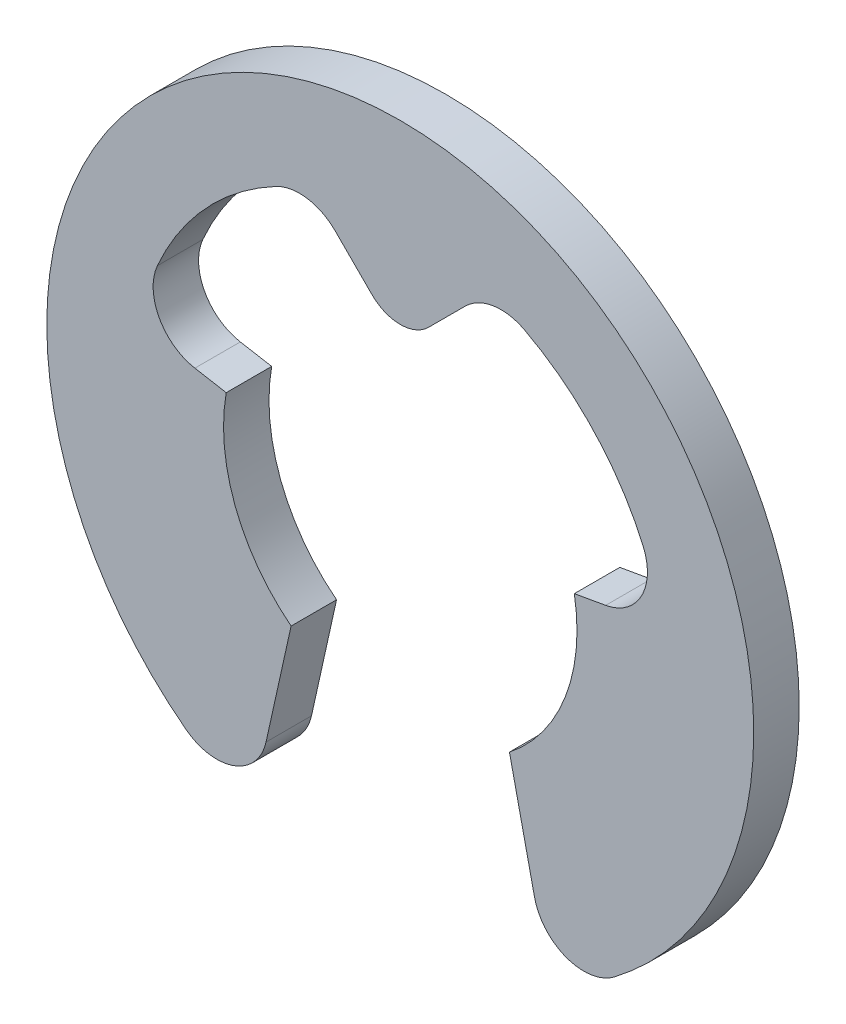
ISO-10303-21;
HEADER;
FILE_DESCRIPTION(('STEP AP214'),'2;1');
FILE_NAME('part.step','',(''),(''),'','','');
FILE_SCHEMA(('AUTOMOTIVE_DESIGN { 1 0 10303 214 1 1 1 1 }'));
ENDSEC;
DATA;
#1=APPLICATION_CONTEXT('core data for automotive mechanical design processes');
#2=APPLICATION_PROTOCOL_DEFINITION('international standard','automotive_design',2000,#1);
#3=PRODUCT_CONTEXT('',#1,'mechanical');
#4=PRODUCT('Part','Part','',(#3));
#5=PRODUCT_RELATED_PRODUCT_CATEGORY('part','',(#4));
#6=PRODUCT_DEFINITION_FORMATION('','',#4);
#7=PRODUCT_DEFINITION_CONTEXT('part definition',#1,'design');
#8=PRODUCT_DEFINITION('design','',#6,#7);
#9=PRODUCT_DEFINITION_SHAPE('','',#8);
#10=(LENGTH_UNIT() NAMED_UNIT(*) SI_UNIT(.MILLI.,.METRE.));
#11=(NAMED_UNIT(*) PLANE_ANGLE_UNIT() SI_UNIT($,.RADIAN.));
#12=(NAMED_UNIT(*) SI_UNIT($,.STERADIAN.) SOLID_ANGLE_UNIT());
#13=UNCERTAINTY_MEASURE_WITH_UNIT(LENGTH_MEASURE(1.E-05),#10,'distance_accuracy_value','');
#14=(GEOMETRIC_REPRESENTATION_CONTEXT(3) GLOBAL_UNCERTAINTY_ASSIGNED_CONTEXT((#13)) GLOBAL_UNIT_ASSIGNED_CONTEXT((#10,
#11,#12)) REPRESENTATION_CONTEXT('',''));
#15=CARTESIAN_POINT('',(0.,0.,0.));
#16=DIRECTION('',(0.,0.,1.));
#17=DIRECTION('',(1.,0.,0.));
#18=AXIS2_PLACEMENT_3D('',#15,#16,#17);
#19=CARTESIAN_POINT('',(-3.89427545375485,1.70209244469343,0.9));
#20=DIRECTION('',(0.,0.,-1.));
#21=DIRECTION('',(-1.,0.,0.));
#22=AXIS2_PLACEMENT_3D('',#19,#20,#21);
#23=CYLINDRICAL_SURFACE('',#22,1.);
#24=CARTESIAN_POINT('',(-3.89427545375485,1.70209244469343,0.));
#25=DIRECTION('',(0.,0.,-1.));
#26=DIRECTION('',(-1.,0.,0.));
#27=AXIS2_PLACEMENT_3D('',#24,#25,#26);
#28=CIRCLE('',#27,1.);
#29=CARTESIAN_POINT('',(-4.06792363142178,0.717284691681221,0.));
#30=VERTEX_POINT('',#29);
#31=CARTESIAN_POINT('',(-4.8105755605207,2.10258478462129,0.));
#32=VERTEX_POINT('',#31);
#33=EDGE_CURVE('E161',#30,#32,#28,.T.);
#34=ORIENTED_EDGE('',*,*,#33,.T.);
#35=DIRECTION('',(0.,0.,-1.));
#36=VECTOR('',#35,1.);
#37=CARTESIAN_POINT('',(-4.8105755605207,2.10258478462129,0.9));
#38=LINE('',#37,#36);
#39=CARTESIAN_POINT('',(-4.8105755605207,2.10258478462129,0.9));
#40=VERTEX_POINT('',#39);
#41=EDGE_CURVE('E11',#40,#32,#38,.T.);
#42=ORIENTED_EDGE('',*,*,#41,.F.);
#43=CARTESIAN_POINT('',(-3.89427545375485,1.70209244469343,0.9));
#44=DIRECTION('',(0.,0.,-1.));
#45=DIRECTION('',(-1.,0.,0.));
#46=AXIS2_PLACEMENT_3D('',#43,#44,#45);
#47=CIRCLE('',#46,1.);
#48=CARTESIAN_POINT('',(-4.06792363142178,0.717284691681221,0.9));
#49=VERTEX_POINT('',#48);
#50=EDGE_CURVE('E208',#49,#40,#47,.T.);
#51=ORIENTED_EDGE('',*,*,#50,.F.);
#52=DIRECTION('',(0.,0.,-1.));
#53=VECTOR('',#52,1.);
#54=CARTESIAN_POINT('',(-4.06792363142178,0.717284691681221,0.9));
#55=LINE('',#54,#53);
#56=EDGE_CURVE('E174',#49,#30,#55,.T.);
#57=ORIENTED_EDGE('',*,*,#56,.T.);
#58=EDGE_LOOP('',(#34,#42,#51,#57));
#59=FACE_BOUND('',#58,.T.);
#60=ADVANCED_FACE('F33',(#59),#23,.F.);
#61=CARTESIAN_POINT('',(0.,0.,0.9));
#62=DIRECTION('',(0.,0.,-1.));
#63=DIRECTION('',(-1.,0.,0.));
#64=AXIS2_PLACEMENT_3D('',#61,#62,#63);
#65=CYLINDRICAL_SURFACE('',#64,5.25);
#66=CARTESIAN_POINT('',(0.,0.,0.));
#67=DIRECTION('',(0.,0.,-1.));
#68=DIRECTION('',(1.,0.,0.));
#69=AXIS2_PLACEMENT_3D('',#66,#67,#68);
#70=CIRCLE('',#69,5.25);
#71=CARTESIAN_POINT('',(-2.46474887837395,4.63546254073468,0.));
#72=VERTEX_POINT('',#71);
#73=EDGE_CURVE('E157',#32,#72,#70,.T.);
#74=ORIENTED_EDGE('',*,*,#73,.T.);
#75=DIRECTION('',(0.,0.,-1.));
#76=VECTOR('',#75,1.);
#77=CARTESIAN_POINT('',(-2.46474887837395,4.63546254073468,0.9));
#78=LINE('',#77,#76);
#79=CARTESIAN_POINT('',(-2.46474887837395,4.63546254073468,0.9));
#80=VERTEX_POINT('',#79);
#81=EDGE_CURVE('E40',#80,#72,#78,.T.);
#82=ORIENTED_EDGE('',*,*,#81,.F.);
#83=CARTESIAN_POINT('',(0.,0.,0.9));
#84=DIRECTION('',(0.,0.,-1.));
#85=DIRECTION('',(1.,0.,0.));
#86=AXIS2_PLACEMENT_3D('',#83,#84,#85);
#87=CIRCLE('',#86,5.25);
#88=EDGE_CURVE('E170',#40,#80,#87,.T.);
#89=ORIENTED_EDGE('',*,*,#88,.F.);
#90=ORIENTED_EDGE('',*,*,#41,.T.);
#91=EDGE_LOOP('',(#74,#82,#89,#90));
#92=FACE_BOUND('',#91,.T.);
#93=ADVANCED_FACE('F169',(#92),#65,.F.);
#94=CARTESIAN_POINT('',(-1.99527290154081,3.75251729488045,0.9));
#95=DIRECTION('',(0.,0.,-1.));
#96=DIRECTION('',(-1.,0.,0.));
#97=AXIS2_PLACEMENT_3D('',#94,#95,#96);
#98=CYLINDRICAL_SURFACE('',#97,1.);
#99=CARTESIAN_POINT('',(-1.99527290154081,3.75251729488045,0.));
#100=DIRECTION('',(0.,0.,-1.));
#101=DIRECTION('',(-1.,0.,0.));
#102=AXIS2_PLACEMENT_3D('',#99,#100,#101);
#103=CIRCLE('',#102,1.);
#104=CARTESIAN_POINT('',(-1.28816612035427,4.459624076067,0.));
#105=VERTEX_POINT('',#104);
#106=EDGE_CURVE('E163',#72,#105,#103,.T.);
#107=ORIENTED_EDGE('',*,*,#106,.T.);
#108=DIRECTION('',(0.,0.,-1.));
#109=VECTOR('',#108,1.);
#110=CARTESIAN_POINT('',(-1.28816612035427,4.459624076067,0.9));
#111=LINE('',#110,#109);
#112=CARTESIAN_POINT('',(-1.28816612035427,4.459624076067,0.9));
#113=VERTEX_POINT('',#112);
#114=EDGE_CURVE('E284',#113,#105,#111,.T.);
#115=ORIENTED_EDGE('',*,*,#114,.F.);
#116=CARTESIAN_POINT('',(-1.99527290154081,3.75251729488045,0.9));
#117=DIRECTION('',(0.,0.,-1.));
#118=DIRECTION('',(-1.,0.,0.));
#119=AXIS2_PLACEMENT_3D('',#116,#117,#118);
#120=CIRCLE('',#119,1.);
#121=EDGE_CURVE('E211',#80,#113,#120,.T.);
#122=ORIENTED_EDGE('',*,*,#121,.F.);
#123=ORIENTED_EDGE('',*,*,#81,.T.);
#124=EDGE_LOOP('',(#107,#115,#122,#123));
#125=FACE_BOUND('',#124,.T.);
#126=ADVANCED_FACE('F288',(#125),#98,.F.);
#127=CARTESIAN_POINT('',(-0.560856351707681,3.73231430742042,0.9));
#128=DIRECTION('',(0.707106781186547,0.707106781186548,0.));
#129=DIRECTION('',(-0.707106781186548,0.707106781186547,0.));
#130=AXIS2_PLACEMENT_3D('',#127,#128,#129);
#131=PLANE('',#130);
#132=DIRECTION('',(0.707106781186548,-0.707106781186547,0.));
#133=VECTOR('',#132,1.);
#134=CARTESIAN_POINT('',(-0.560856351707681,3.73231430742042,0.));
#135=LINE('',#134,#133);
#136=CARTESIAN_POINT('',(-0.560856351707681,3.73231430742042,0.));
#137=VERTEX_POINT('',#136);
#138=EDGE_CURVE('E178',#105,#137,#135,.T.);
#139=ORIENTED_EDGE('',*,*,#138,.T.);
#140=DIRECTION('',(0.,0.,-1.));
#141=VECTOR('',#140,1.);
#142=CARTESIAN_POINT('',(-0.560856351707681,3.73231430742042,0.9));
#143=LINE('',#142,#141);
#144=CARTESIAN_POINT('',(-0.560856351707681,3.73231430742042,0.9));
#145=VERTEX_POINT('',#144);
#146=EDGE_CURVE('E281',#145,#137,#143,.T.);
#147=ORIENTED_EDGE('',*,*,#146,.F.);
#148=DIRECTION('',(0.707106781186548,-0.707106781186547,0.));
#149=VECTOR('',#148,1.);
#150=CARTESIAN_POINT('',(-0.560856351707681,3.73231430742042,0.9));
#151=LINE('',#150,#149);
#152=EDGE_CURVE('E213',#113,#145,#151,.T.);
#153=ORIENTED_EDGE('',*,*,#152,.F.);
#154=ORIENTED_EDGE('',*,*,#114,.T.);
#155=EDGE_LOOP('',(#139,#147,#153,#154));
#156=FACE_BOUND('',#155,.T.);
#157=ADVANCED_FACE('F296',(#156),#131,.F.);
#158=CARTESIAN_POINT('',(0.,4.2931706591281,0.9));
#159=DIRECTION('',(0.,0.,-1.));
#160=DIRECTION('',(-1.,0.,0.));
#161=AXIS2_PLACEMENT_3D('',#158,#159,#160);
#162=CYLINDRICAL_SURFACE('',#161,0.793170659128098);
#163=CARTESIAN_POINT('',(0.,4.2931706591281,0.));
#164=DIRECTION('',(0.,0.,1.));
#165=DIRECTION('',(1.,0.,0.));
#166=AXIS2_PLACEMENT_3D('',#163,#164,#165);
#167=CIRCLE('',#166,0.793170659128098);
#168=CARTESIAN_POINT('',(0.560856351707681,3.73231430742042,0.));
#169=VERTEX_POINT('',#168);
#170=EDGE_CURVE('E180',#137,#169,#167,.T.);
#171=ORIENTED_EDGE('',*,*,#170,.T.);
#172=DIRECTION('',(0.,0.,-1.));
#173=VECTOR('',#172,1.);
#174=CARTESIAN_POINT('',(0.560856351707681,3.73231430742042,0.9));
#175=LINE('',#174,#173);
#176=CARTESIAN_POINT('',(0.560856351707681,3.73231430742042,0.9));
#177=VERTEX_POINT('',#176);
#178=EDGE_CURVE('E278',#177,#169,#175,.T.);
#179=ORIENTED_EDGE('',*,*,#178,.F.);
#180=CARTESIAN_POINT('',(0.,4.2931706591281,0.9));
#181=DIRECTION('',(0.,0.,1.));
#182=DIRECTION('',(1.,0.,0.));
#183=AXIS2_PLACEMENT_3D('',#180,#181,#182);
#184=CIRCLE('',#183,0.793170659128098);
#185=EDGE_CURVE('E215',#145,#177,#184,.T.);
#186=ORIENTED_EDGE('',*,*,#185,.F.);
#187=ORIENTED_EDGE('',*,*,#146,.T.);
#188=EDGE_LOOP('',(#171,#179,#186,#187));
#189=FACE_BOUND('',#188,.T.);
#190=ADVANCED_FACE('F299',(#189),#162,.T.);
#191=CARTESIAN_POINT('',(0.560856351707681,3.73231430742042,0.9));
#192=DIRECTION('',(-0.707106781186547,0.707106781186548,0.));
#193=DIRECTION('',(-0.707106781186548,-0.707106781186547,0.));
#194=AXIS2_PLACEMENT_3D('',#191,#192,#193);
#195=PLANE('',#194);
#196=DIRECTION('',(0.707106781186548,0.707106781186547,0.));
#197=VECTOR('',#196,1.);
#198=CARTESIAN_POINT('',(0.560856351707681,3.73231430742042,0.));
#199=LINE('',#198,#197);
#200=CARTESIAN_POINT('',(1.28816612035427,4.459624076067,0.));
#201=VERTEX_POINT('',#200);
#202=EDGE_CURVE('E182',#169,#201,#199,.T.);
#203=ORIENTED_EDGE('',*,*,#202,.T.);
#204=DIRECTION('',(0.,0.,-1.));
#205=VECTOR('',#204,1.);
#206=CARTESIAN_POINT('',(1.28816612035427,4.459624076067,0.9));
#207=LINE('',#206,#205);
#208=CARTESIAN_POINT('',(1.28816612035427,4.459624076067,0.9));
#209=VERTEX_POINT('',#208);
#210=EDGE_CURVE('E275',#209,#201,#207,.T.);
#211=ORIENTED_EDGE('',*,*,#210,.F.);
#212=DIRECTION('',(0.707106781186548,0.707106781186547,0.));
#213=VECTOR('',#212,1.);
#214=CARTESIAN_POINT('',(0.560856351707681,3.73231430742042,0.9));
#215=LINE('',#214,#213);
#216=EDGE_CURVE('E217',#177,#209,#215,.T.);
#217=ORIENTED_EDGE('',*,*,#216,.F.);
#218=ORIENTED_EDGE('',*,*,#178,.T.);
#219=EDGE_LOOP('',(#203,#211,#217,#218));
#220=FACE_BOUND('',#219,.T.);
#221=ADVANCED_FACE('F304',(#220),#195,.F.);
#222=CARTESIAN_POINT('',(1.99527290154081,3.75251729488045,0.9));
#223=DIRECTION('',(0.,0.,-1.));
#224=DIRECTION('',(-1.,0.,0.));
#225=AXIS2_PLACEMENT_3D('',#222,#223,#224);
#226=CYLINDRICAL_SURFACE('',#225,1.);
#227=CARTESIAN_POINT('',(1.99527290154081,3.75251729488045,0.));
#228=DIRECTION('',(0.,0.,-1.));
#229=DIRECTION('',(1.,0.,0.));
#230=AXIS2_PLACEMENT_3D('',#227,#228,#229);
#231=CIRCLE('',#230,1.);
#232=CARTESIAN_POINT('',(2.46474887837395,4.63546254073468,0.));
#233=VERTEX_POINT('',#232);
#234=EDGE_CURVE('E184',#201,#233,#231,.T.);
#235=ORIENTED_EDGE('',*,*,#234,.T.);
#236=DIRECTION('',(0.,0.,-1.));
#237=VECTOR('',#236,1.);
#238=CARTESIAN_POINT('',(2.46474887837395,4.63546254073468,0.9));
#239=LINE('',#238,#237);
#240=CARTESIAN_POINT('',(2.46474887837395,4.63546254073468,0.9));
#241=VERTEX_POINT('',#240);
#242=EDGE_CURVE('E272',#241,#233,#239,.T.);
#243=ORIENTED_EDGE('',*,*,#242,.F.);
#244=CARTESIAN_POINT('',(1.99527290154081,3.75251729488045,0.9));
#245=DIRECTION('',(0.,0.,-1.));
#246=DIRECTION('',(1.,0.,0.));
#247=AXIS2_PLACEMENT_3D('',#244,#245,#246);
#248=CIRCLE('',#247,1.);
#249=EDGE_CURVE('E219',#209,#241,#248,.T.);
#250=ORIENTED_EDGE('',*,*,#249,.F.);
#251=ORIENTED_EDGE('',*,*,#210,.T.);
#252=EDGE_LOOP('',(#235,#243,#250,#251));
#253=FACE_BOUND('',#252,.T.);
#254=ADVANCED_FACE('F310',(#253),#226,.F.);
#255=CARTESIAN_POINT('',(0.,0.,0.9));
#256=DIRECTION('',(0.,0.,-1.));
#257=DIRECTION('',(-1.,0.,0.));
#258=AXIS2_PLACEMENT_3D('',#255,#256,#257);
#259=CYLINDRICAL_SURFACE('',#258,5.25);
#260=CARTESIAN_POINT('',(0.,0.,0.));
#261=DIRECTION('',(0.,0.,-1.));
#262=DIRECTION('',(1.,0.,0.));
#263=AXIS2_PLACEMENT_3D('',#260,#261,#262);
#264=CIRCLE('',#263,5.25);
#265=CARTESIAN_POINT('',(4.8105755605207,2.10258478462129,0.));
#266=VERTEX_POINT('',#265);
#267=EDGE_CURVE('E186',#233,#266,#264,.T.);
#268=ORIENTED_EDGE('',*,*,#267,.T.);
#269=DIRECTION('',(0.,0.,-1.));
#270=VECTOR('',#269,1.);
#271=CARTESIAN_POINT('',(4.8105755605207,2.10258478462129,0.9));
#272=LINE('',#271,#270);
#273=CARTESIAN_POINT('',(4.8105755605207,2.10258478462129,0.9));
#274=VERTEX_POINT('',#273);
#275=EDGE_CURVE('E269',#274,#266,#272,.T.);
#276=ORIENTED_EDGE('',*,*,#275,.F.);
#277=CARTESIAN_POINT('',(0.,0.,0.9));
#278=DIRECTION('',(0.,0.,-1.));
#279=DIRECTION('',(1.,0.,0.));
#280=AXIS2_PLACEMENT_3D('',#277,#278,#279);
#281=CIRCLE('',#280,5.25);
#282=EDGE_CURVE('E221',#241,#274,#281,.T.);
#283=ORIENTED_EDGE('',*,*,#282,.F.);
#284=ORIENTED_EDGE('',*,*,#242,.T.);
#285=EDGE_LOOP('',(#268,#276,#283,#284));
#286=FACE_BOUND('',#285,.T.);
#287=ADVANCED_FACE('F314',(#286),#259,.F.);
#288=CARTESIAN_POINT('',(3.89427545375485,1.70209244469343,0.9));
#289=DIRECTION('',(0.,0.,-1.));
#290=DIRECTION('',(-1.,0.,0.));
#291=AXIS2_PLACEMENT_3D('',#288,#289,#290);
#292=CYLINDRICAL_SURFACE('',#291,1.);
#293=CARTESIAN_POINT('',(3.89427545375485,1.70209244469343,0.));
#294=DIRECTION('',(0.,0.,-1.));
#295=DIRECTION('',(-1.,0.,0.));
#296=AXIS2_PLACEMENT_3D('',#293,#294,#295);
#297=CIRCLE('',#296,1.);
#298=CARTESIAN_POINT('',(4.06792363142178,0.717284691681221,0.));
#299=VERTEX_POINT('',#298);
#300=EDGE_CURVE('E188',#266,#299,#297,.T.);
#301=ORIENTED_EDGE('',*,*,#300,.T.);
#302=DIRECTION('',(0.,0.,-1.));
#303=VECTOR('',#302,1.);
#304=CARTESIAN_POINT('',(4.06792363142178,0.717284691681221,0.9));
#305=LINE('',#304,#303);
#306=CARTESIAN_POINT('',(4.06792363142178,0.717284691681221,0.9));
#307=VERTEX_POINT('',#306);
#308=EDGE_CURVE('E266',#307,#299,#305,.T.);
#309=ORIENTED_EDGE('',*,*,#308,.F.);
#310=CARTESIAN_POINT('',(3.89427545375485,1.70209244469343,0.9));
#311=DIRECTION('',(0.,0.,-1.));
#312=DIRECTION('',(-1.,0.,0.));
#313=AXIS2_PLACEMENT_3D('',#310,#311,#312);
#314=CIRCLE('',#313,1.);
#315=EDGE_CURVE('E223',#274,#307,#314,.T.);
#316=ORIENTED_EDGE('',*,*,#315,.F.);
#317=ORIENTED_EDGE('',*,*,#275,.T.);
#318=EDGE_LOOP('',(#301,#309,#316,#317));
#319=FACE_BOUND('',#318,.T.);
#320=ADVANCED_FACE('F319',(#319),#292,.F.);
#321=CARTESIAN_POINT('',(3.44682713554273,0.607768621834259,0.9));
#322=DIRECTION('',(0.173648177666931,-0.984807753012208,0.));
#323=DIRECTION('',(0.984807753012208,0.173648177666931,0.));
#324=AXIS2_PLACEMENT_3D('',#321,#322,#323);
#325=PLANE('',#324);
#326=DIRECTION('',(-0.984807753012208,-0.173648177666931,0.));
#327=VECTOR('',#326,1.);
#328=CARTESIAN_POINT('',(3.44682713554273,0.607768621834259,0.));
#329=LINE('',#328,#327);
#330=CARTESIAN_POINT('',(3.44682713554273,0.607768621834259,0.));
#331=VERTEX_POINT('',#330);
#332=EDGE_CURVE('E190',#299,#331,#329,.T.);
#333=ORIENTED_EDGE('',*,*,#332,.T.);
#334=DIRECTION('',(0.,0.,-1.));
#335=VECTOR('',#334,1.);
#336=CARTESIAN_POINT('',(3.44682713554273,0.607768621834259,0.9));
#337=LINE('',#336,#335);
#338=CARTESIAN_POINT('',(3.44682713554273,0.607768621834259,0.9));
#339=VERTEX_POINT('',#338);
#340=EDGE_CURVE('E263',#339,#331,#337,.T.);
#341=ORIENTED_EDGE('',*,*,#340,.F.);
#342=DIRECTION('',(-0.984807753012208,-0.173648177666931,0.));
#343=VECTOR('',#342,1.);
#344=CARTESIAN_POINT('',(3.44682713554273,0.607768621834259,0.9));
#345=LINE('',#344,#343);
#346=EDGE_CURVE('E225',#307,#339,#345,.T.);
#347=ORIENTED_EDGE('',*,*,#346,.F.);
#348=ORIENTED_EDGE('',*,*,#308,.T.);
#349=EDGE_LOOP('',(#333,#341,#347,#348));
#350=FACE_BOUND('',#349,.T.);
#351=ADVANCED_FACE('F325',(#350),#325,.F.);
#352=CARTESIAN_POINT('',(0.,0.,0.9));
#353=DIRECTION('',(0.,0.,-1.));
#354=DIRECTION('',(-1.,0.,0.));
#355=AXIS2_PLACEMENT_3D('',#352,#353,#354);
#356=CYLINDRICAL_SURFACE('',#355,3.5);
#357=CARTESIAN_POINT('',(0.,0.,0.));
#358=DIRECTION('',(0.,0.,-1.));
#359=DIRECTION('',(1.,0.,0.));
#360=AXIS2_PLACEMENT_3D('',#357,#358,#359);
#361=CIRCLE('',#360,3.5);
#362=CARTESIAN_POINT('',(2.16204858971483,-2.7523709589574,0.));
#363=VERTEX_POINT('',#362);
#364=EDGE_CURVE('E192',#331,#363,#361,.T.);
#365=ORIENTED_EDGE('',*,*,#364,.T.);
#366=DIRECTION('',(0.,0.,-1.));
#367=VECTOR('',#366,1.);
#368=CARTESIAN_POINT('',(2.16204858971483,-2.7523709589574,0.9));
#369=LINE('',#368,#367);
#370=CARTESIAN_POINT('',(2.16204858971483,-2.7523709589574,0.9));
#371=VERTEX_POINT('',#370);
#372=EDGE_CURVE('E260',#371,#363,#369,.T.);
#373=ORIENTED_EDGE('',*,*,#372,.F.);
#374=CARTESIAN_POINT('',(0.,0.,0.9));
#375=DIRECTION('',(0.,0.,-1.));
#376=DIRECTION('',(1.,0.,0.));
#377=AXIS2_PLACEMENT_3D('',#374,#375,#376);
#378=CIRCLE('',#377,3.5);
#379=EDGE_CURVE('E227',#339,#371,#378,.T.);
#380=ORIENTED_EDGE('',*,*,#379,.F.);
#381=ORIENTED_EDGE('',*,*,#340,.T.);
#382=EDGE_LOOP('',(#365,#373,#380,#381));
#383=FACE_BOUND('',#382,.T.);
#384=ADVANCED_FACE('F329',(#383),#356,.F.);
#385=CARTESIAN_POINT('',(2.16204858971483,-2.7523709589574,0.9));
#386=DIRECTION('',(0.976296007119934,0.2164396139381,0.));
#387=DIRECTION('',(-0.2164396139381,0.976296007119934,0.));
#388=AXIS2_PLACEMENT_3D('',#385,#386,#387);
#389=PLANE('',#388);
#390=DIRECTION('',(0.2164396139381,-0.976296007119934,0.));
#391=VECTOR('',#390,1.);
#392=CARTESIAN_POINT('',(2.16204858971483,-2.7523709589574,0.));
#393=LINE('',#392,#391);
#394=CARTESIAN_POINT('',(2.65820142826365,-4.99037178691565,0.));
#395=VERTEX_POINT('',#394);
#396=EDGE_CURVE('E194',#363,#395,#393,.T.);
#397=ORIENTED_EDGE('',*,*,#396,.T.);
#398=DIRECTION('',(0.,0.,-1.));
#399=VECTOR('',#398,1.);
#400=CARTESIAN_POINT('',(2.65820142826365,-4.99037178691565,0.9));
#401=LINE('',#400,#399);
#402=CARTESIAN_POINT('',(2.65820142826365,-4.99037178691565,0.9));
#403=VERTEX_POINT('',#402);
#404=EDGE_CURVE('E257',#403,#395,#401,.T.);
#405=ORIENTED_EDGE('',*,*,#404,.F.);
#406=DIRECTION('',(0.2164396139381,-0.976296007119934,0.));
#407=VECTOR('',#406,1.);
#408=CARTESIAN_POINT('',(2.16204858971483,-2.7523709589574,0.9));
#409=LINE('',#408,#407);
#410=EDGE_CURVE('E229',#371,#403,#409,.T.);
#411=ORIENTED_EDGE('',*,*,#410,.F.);
#412=ORIENTED_EDGE('',*,*,#372,.T.);
#413=EDGE_LOOP('',(#397,#405,#411,#412));
#414=FACE_BOUND('',#413,.T.);
#415=ADVANCED_FACE('F334',(#414),#389,.F.);
#416=CARTESIAN_POINT('',(3.63449743538359,-4.77393217297755,0.9));
#417=DIRECTION('',(0.,0.,-1.));
#418=DIRECTION('',(-1.,0.,0.));
#419=AXIS2_PLACEMENT_3D('',#416,#417,#418);
#420=CYLINDRICAL_SURFACE('',#419,1.);
#421=CARTESIAN_POINT('',(3.63449743538359,-4.77393217297755,0.));
#422=DIRECTION('',(0.,0.,1.));
#423=DIRECTION('',(-1.,0.,0.));
#424=AXIS2_PLACEMENT_3D('',#421,#422,#423);
#425=CIRCLE('',#424,1.);
#426=CARTESIAN_POINT('',(4.24024700794752,-5.56958753514048,0.));
#427=VERTEX_POINT('',#426);
#428=EDGE_CURVE('E196',#395,#427,#425,.T.);
#429=ORIENTED_EDGE('',*,*,#428,.T.);
#430=DIRECTION('',(0.,0.,-1.));
#431=VECTOR('',#430,1.);
#432=CARTESIAN_POINT('',(4.24024700794752,-5.56958753514048,0.9));
#433=LINE('',#432,#431);
#434=CARTESIAN_POINT('',(4.24024700794752,-5.56958753514048,0.9));
#435=VERTEX_POINT('',#434);
#436=EDGE_CURVE('E254',#435,#427,#433,.T.);
#437=ORIENTED_EDGE('',*,*,#436,.F.);
#438=CARTESIAN_POINT('',(3.63449743538359,-4.77393217297755,0.9));
#439=DIRECTION('',(0.,0.,1.));
#440=DIRECTION('',(-1.,0.,0.));
#441=AXIS2_PLACEMENT_3D('',#438,#439,#440);
#442=CIRCLE('',#441,1.);
#443=EDGE_CURVE('E231',#403,#435,#442,.T.);
#444=ORIENTED_EDGE('',*,*,#443,.F.);
#445=ORIENTED_EDGE('',*,*,#404,.T.);
#446=EDGE_LOOP('',(#429,#437,#444,#445));
#447=FACE_BOUND('',#446,.T.);
#448=ADVANCED_FACE('F340',(#447),#420,.T.);
#449=CARTESIAN_POINT('',(0.,0.,0.9));
#450=DIRECTION('',(0.,0.,-1.));
#451=DIRECTION('',(-1.,0.,0.));
#452=AXIS2_PLACEMENT_3D('',#449,#450,#451);
#453=CYLINDRICAL_SURFACE('',#452,7.);
#454=CARTESIAN_POINT('',(0.,0.,0.));
#455=DIRECTION('',(0.,0.,1.));
#456=DIRECTION('',(1.,0.,0.));
#457=AXIS2_PLACEMENT_3D('',#454,#455,#456);
#458=CIRCLE('',#457,7.);
#459=CARTESIAN_POINT('',(-4.24024700794752,-5.56958753514048,0.));
#460=VERTEX_POINT('',#459);
#461=EDGE_CURVE('E198',#427,#460,#458,.T.);
#462=ORIENTED_EDGE('',*,*,#461,.T.);
#463=DIRECTION('',(0.,0.,-1.));
#464=VECTOR('',#463,1.);
#465=CARTESIAN_POINT('',(-4.24024700794752,-5.56958753514048,0.9));
#466=LINE('',#465,#464);
#467=CARTESIAN_POINT('',(-4.24024700794752,-5.56958753514048,0.9));
#468=VERTEX_POINT('',#467);
#469=EDGE_CURVE('E251',#468,#460,#466,.T.);
#470=ORIENTED_EDGE('',*,*,#469,.F.);
#471=CARTESIAN_POINT('',(0.,0.,0.9));
#472=DIRECTION('',(0.,0.,1.));
#473=DIRECTION('',(1.,0.,0.));
#474=AXIS2_PLACEMENT_3D('',#471,#472,#473);
#475=CIRCLE('',#474,7.);
#476=EDGE_CURVE('E233',#435,#468,#475,.T.);
#477=ORIENTED_EDGE('',*,*,#476,.F.);
#478=ORIENTED_EDGE('',*,*,#436,.T.);
#479=EDGE_LOOP('',(#462,#470,#477,#478));
#480=FACE_BOUND('',#479,.T.);
#481=ADVANCED_FACE('F344',(#480),#453,.T.);
#482=CARTESIAN_POINT('',(-3.63449743538359,-4.77393217297755,0.9));
#483=DIRECTION('',(0.,0.,-1.));
#484=DIRECTION('',(-1.,0.,0.));
#485=AXIS2_PLACEMENT_3D('',#482,#483,#484);
#486=CYLINDRICAL_SURFACE('',#485,1.);
#487=CARTESIAN_POINT('',(-3.63449743538359,-4.77393217297755,0.));
#488=DIRECTION('',(0.,0.,1.));
#489=DIRECTION('',(-1.,0.,0.));
#490=AXIS2_PLACEMENT_3D('',#487,#488,#489);
#491=CIRCLE('',#490,1.);
#492=CARTESIAN_POINT('',(-2.65820142826365,-4.99037178691565,0.));
#493=VERTEX_POINT('',#492);
#494=EDGE_CURVE('E200',#460,#493,#491,.T.);
#495=ORIENTED_EDGE('',*,*,#494,.T.);
#496=DIRECTION('',(0.,0.,-1.));
#497=VECTOR('',#496,1.);
#498=CARTESIAN_POINT('',(-2.65820142826365,-4.99037178691565,0.9));
#499=LINE('',#498,#497);
#500=CARTESIAN_POINT('',(-2.65820142826365,-4.99037178691565,0.9));
#501=VERTEX_POINT('',#500);
#502=EDGE_CURVE('E248',#501,#493,#499,.T.);
#503=ORIENTED_EDGE('',*,*,#502,.F.);
#504=CARTESIAN_POINT('',(-3.63449743538359,-4.77393217297755,0.9));
#505=DIRECTION('',(0.,0.,1.));
#506=DIRECTION('',(-1.,0.,0.));
#507=AXIS2_PLACEMENT_3D('',#504,#505,#506);
#508=CIRCLE('',#507,1.);
#509=EDGE_CURVE('E235',#468,#501,#508,.T.);
#510=ORIENTED_EDGE('',*,*,#509,.F.);
#511=ORIENTED_EDGE('',*,*,#469,.T.);
#512=EDGE_LOOP('',(#495,#503,#510,#511));
#513=FACE_BOUND('',#512,.T.);
#514=ADVANCED_FACE('F349',(#513),#486,.T.);
#515=CARTESIAN_POINT('',(-2.65820142826365,-4.99037178691565,0.9));
#516=DIRECTION('',(-0.976296007119934,0.2164396139381,0.));
#517=DIRECTION('',(-0.2164396139381,-0.976296007119934,0.));
#518=AXIS2_PLACEMENT_3D('',#515,#516,#517);
#519=PLANE('',#518);
#520=DIRECTION('',(0.2164396139381,0.976296007119934,0.));
#521=VECTOR('',#520,1.);
#522=CARTESIAN_POINT('',(-2.65820142826365,-4.99037178691565,0.));
#523=LINE('',#522,#521);
#524=CARTESIAN_POINT('',(-2.16204858971484,-2.7523709589574,0.));
#525=VERTEX_POINT('',#524);
#526=EDGE_CURVE('E202',#493,#525,#523,.T.);
#527=ORIENTED_EDGE('',*,*,#526,.T.);
#528=DIRECTION('',(0.,0.,-1.));
#529=VECTOR('',#528,1.);
#530=CARTESIAN_POINT('',(-2.16204858971484,-2.7523709589574,0.9));
#531=LINE('',#530,#529);
#532=CARTESIAN_POINT('',(-2.16204858971484,-2.7523709589574,0.9));
#533=VERTEX_POINT('',#532);
#534=EDGE_CURVE('E245',#533,#525,#531,.T.);
#535=ORIENTED_EDGE('',*,*,#534,.F.);
#536=DIRECTION('',(0.2164396139381,0.976296007119934,0.));
#537=VECTOR('',#536,1.);
#538=CARTESIAN_POINT('',(-2.65820142826365,-4.99037178691565,0.9));
#539=LINE('',#538,#537);
#540=EDGE_CURVE('E237',#501,#533,#539,.T.);
#541=ORIENTED_EDGE('',*,*,#540,.F.);
#542=ORIENTED_EDGE('',*,*,#502,.T.);
#543=EDGE_LOOP('',(#527,#535,#541,#542));
#544=FACE_BOUND('',#543,.T.);
#545=ADVANCED_FACE('F353',(#544),#519,.F.);
#546=CARTESIAN_POINT('',(0.,0.,0.9));
#547=DIRECTION('',(0.,0.,-1.));
#548=DIRECTION('',(-1.,0.,0.));
#549=AXIS2_PLACEMENT_3D('',#546,#547,#548);
#550=CYLINDRICAL_SURFACE('',#549,3.5);
#551=CARTESIAN_POINT('',(0.,0.,0.));
#552=DIRECTION('',(0.,0.,-1.));
#553=DIRECTION('',(1.,0.,0.));
#554=AXIS2_PLACEMENT_3D('',#551,#552,#553);
#555=CIRCLE('',#554,3.5);
#556=CARTESIAN_POINT('',(-3.44682713554273,0.607768621834259,0.));
#557=VERTEX_POINT('',#556);
#558=EDGE_CURVE('E204',#525,#557,#555,.T.);
#559=ORIENTED_EDGE('',*,*,#558,.T.);
#560=DIRECTION('',(0.,0.,-1.));
#561=VECTOR('',#560,1.);
#562=CARTESIAN_POINT('',(-3.44682713554273,0.607768621834259,0.9));
#563=LINE('',#562,#561);
#564=CARTESIAN_POINT('',(-3.44682713554273,0.607768621834259,0.9));
#565=VERTEX_POINT('',#564);
#566=EDGE_CURVE('E242',#565,#557,#563,.T.);
#567=ORIENTED_EDGE('',*,*,#566,.F.);
#568=CARTESIAN_POINT('',(0.,0.,0.9));
#569=DIRECTION('',(0.,0.,-1.));
#570=DIRECTION('',(1.,0.,0.));
#571=AXIS2_PLACEMENT_3D('',#568,#569,#570);
#572=CIRCLE('',#571,3.5);
#573=EDGE_CURVE('E52',#533,#565,#572,.T.);
#574=ORIENTED_EDGE('',*,*,#573,.F.);
#575=ORIENTED_EDGE('',*,*,#534,.T.);
#576=EDGE_LOOP('',(#559,#567,#574,#575));
#577=FACE_BOUND('',#576,.T.);
#578=ADVANCED_FACE('F357',(#577),#550,.F.);
#579=CARTESIAN_POINT('',(-3.44682713554273,0.607768621834259,0.9));
#580=DIRECTION('',(-0.173648177666931,-0.984807753012208,0.));
#581=DIRECTION('',(0.984807753012208,-0.173648177666931,0.));
#582=AXIS2_PLACEMENT_3D('',#579,#580,#581);
#583=PLANE('',#582);
#584=DIRECTION('',(-0.984807753012208,0.173648177666931,0.));
#585=VECTOR('',#584,1.);
#586=CARTESIAN_POINT('',(-3.44682713554273,0.607768621834259,0.));
#587=LINE('',#586,#585);
#588=EDGE_CURVE('E206',#557,#30,#587,.T.);
#589=ORIENTED_EDGE('',*,*,#588,.T.);
#590=ORIENTED_EDGE('',*,*,#56,.F.);
#591=DIRECTION('',(-0.984807753012208,0.173648177666931,0.));
#592=VECTOR('',#591,1.);
#593=CARTESIAN_POINT('',(-3.44682713554273,0.607768621834259,0.9));
#594=LINE('',#593,#592);
#595=EDGE_CURVE('E47',#565,#49,#594,.T.);
#596=ORIENTED_EDGE('',*,*,#595,.F.);
#597=ORIENTED_EDGE('',*,*,#566,.T.);
#598=EDGE_LOOP('',(#589,#590,#596,#597));
#599=FACE_BOUND('',#598,.T.);
#600=ADVANCED_FACE('F359',(#599),#583,.F.);
#601=CARTESIAN_POINT('',(-3.89427545375485,1.70209244469343,0.9));
#602=DIRECTION('',(0.,0.,-1.));
#603=DIRECTION('',(-1.,0.,0.));
#604=AXIS2_PLACEMENT_3D('',#601,#602,#603);
#605=PLANE('',#604);
#606=ORIENTED_EDGE('',*,*,#50,.T.);
#607=ORIENTED_EDGE('',*,*,#88,.T.);
#608=ORIENTED_EDGE('',*,*,#121,.T.);
#609=ORIENTED_EDGE('',*,*,#152,.T.);
#610=ORIENTED_EDGE('',*,*,#185,.T.);
#611=ORIENTED_EDGE('',*,*,#216,.T.);
#612=ORIENTED_EDGE('',*,*,#249,.T.);
#613=ORIENTED_EDGE('',*,*,#282,.T.);
#614=ORIENTED_EDGE('',*,*,#315,.T.);
#615=ORIENTED_EDGE('',*,*,#346,.T.);
#616=ORIENTED_EDGE('',*,*,#379,.T.);
#617=ORIENTED_EDGE('',*,*,#410,.T.);
#618=ORIENTED_EDGE('',*,*,#443,.T.);
#619=ORIENTED_EDGE('',*,*,#476,.T.);
#620=ORIENTED_EDGE('',*,*,#509,.T.);
#621=ORIENTED_EDGE('',*,*,#540,.T.);
#622=ORIENTED_EDGE('',*,*,#573,.T.);
#623=ORIENTED_EDGE('',*,*,#595,.T.);
#624=EDGE_LOOP('',(#606,#607,#608,#609,#610,#611,#612,#613,#614,#615,#616,#617,#618,#619,#620,
#621,#622,#623));
#625=FACE_BOUND('',#624,.T.);
#626=ADVANCED_FACE('F291',(#625),#605,.F.);
#627=CARTESIAN_POINT('',(-3.89427545375485,1.70209244469343,0.));
#628=DIRECTION('',(0.,0.,-1.));
#629=DIRECTION('',(-1.,0.,0.));
#630=AXIS2_PLACEMENT_3D('',#627,#628,#629);
#631=PLANE('',#630);
#632=ORIENTED_EDGE('',*,*,#33,.F.);
#633=ORIENTED_EDGE('',*,*,#588,.F.);
#634=ORIENTED_EDGE('',*,*,#558,.F.);
#635=ORIENTED_EDGE('',*,*,#526,.F.);
#636=ORIENTED_EDGE('',*,*,#494,.F.);
#637=ORIENTED_EDGE('',*,*,#461,.F.);
#638=ORIENTED_EDGE('',*,*,#428,.F.);
#639=ORIENTED_EDGE('',*,*,#396,.F.);
#640=ORIENTED_EDGE('',*,*,#364,.F.);
#641=ORIENTED_EDGE('',*,*,#332,.F.);
#642=ORIENTED_EDGE('',*,*,#300,.F.);
#643=ORIENTED_EDGE('',*,*,#267,.F.);
#644=ORIENTED_EDGE('',*,*,#234,.F.);
#645=ORIENTED_EDGE('',*,*,#202,.F.);
#646=ORIENTED_EDGE('',*,*,#170,.F.);
#647=ORIENTED_EDGE('',*,*,#138,.F.);
#648=ORIENTED_EDGE('',*,*,#106,.F.);
#649=ORIENTED_EDGE('',*,*,#73,.F.);
#650=EDGE_LOOP('',(#632,#633,#634,#635,#636,#637,#638,#639,#640,#641,#642,#643,#644,#645,#646,
#647,#648,#649));
#651=FACE_BOUND('',#650,.T.);
#652=ADVANCED_FACE('F158',(#651),#631,.T.);
#653=CLOSED_SHELL('',(#60,#93,#126,#157,#190,#221,#254,#287,#320,#351,#384,#415,#448,#481,#514,
#545,#578,#600,#626,#652));
#654=MANIFOLD_SOLID_BREP('B2',#653);
#655=ADVANCED_BREP_SHAPE_REPRESENTATION('',(#18,#654),#14);
#656=SHAPE_DEFINITION_REPRESENTATION(#9,#655);
ENDSEC;
END-ISO-10303-21;
